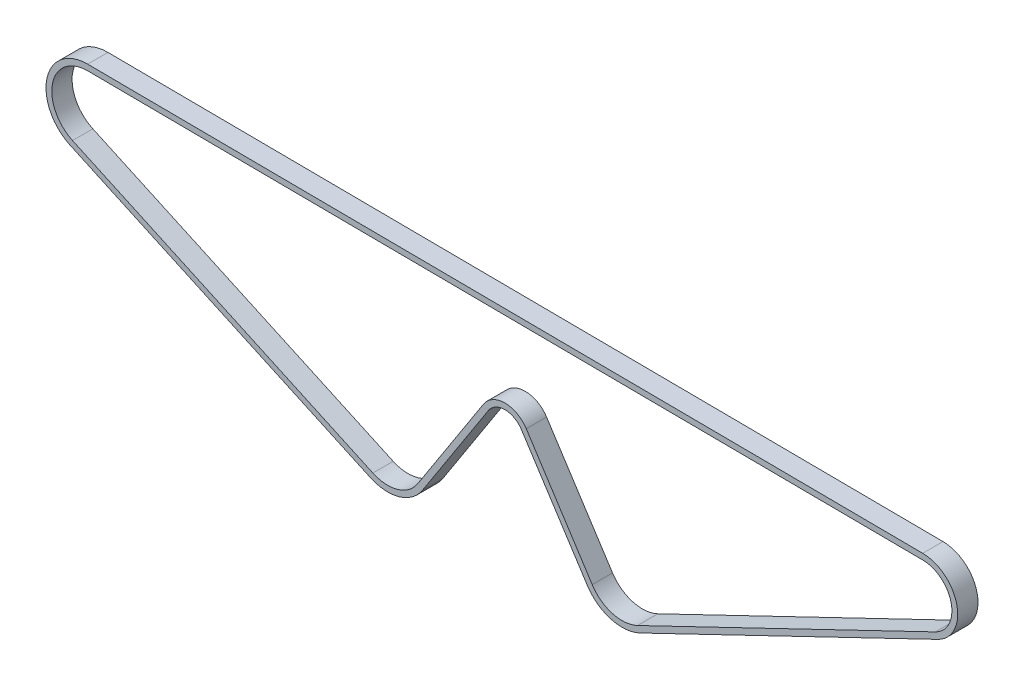
ISO-10303-21;
HEADER;
FILE_DESCRIPTION(('STEP AP214'),'2;1');
FILE_NAME('part.step','',(''),(''),'','','');
FILE_SCHEMA(('AUTOMOTIVE_DESIGN { 1 0 10303 214 1 1 1 1 }'));
ENDSEC;
DATA;
#1=APPLICATION_CONTEXT('core data for automotive mechanical design processes');
#2=APPLICATION_PROTOCOL_DEFINITION('international standard','automotive_design',2000,#1);
#3=PRODUCT_CONTEXT('',#1,'mechanical');
#4=PRODUCT('Part','Part','',(#3));
#5=PRODUCT_RELATED_PRODUCT_CATEGORY('part','',(#4));
#6=PRODUCT_DEFINITION_FORMATION('','',#4);
#7=PRODUCT_DEFINITION_CONTEXT('part definition',#1,'design');
#8=PRODUCT_DEFINITION('design','',#6,#7);
#9=PRODUCT_DEFINITION_SHAPE('','',#8);
#10=(LENGTH_UNIT() NAMED_UNIT(*) SI_UNIT(.MILLI.,.METRE.));
#11=(NAMED_UNIT(*) PLANE_ANGLE_UNIT() SI_UNIT($,.RADIAN.));
#12=(NAMED_UNIT(*) SI_UNIT($,.STERADIAN.) SOLID_ANGLE_UNIT());
#13=UNCERTAINTY_MEASURE_WITH_UNIT(LENGTH_MEASURE(1.E-05),#10,'distance_accuracy_value','');
#14=(GEOMETRIC_REPRESENTATION_CONTEXT(3) GLOBAL_UNCERTAINTY_ASSIGNED_CONTEXT((#13)) GLOBAL_UNIT_ASSIGNED_CONTEXT((#10,
#11,#12)) REPRESENTATION_CONTEXT('',''));
#15=CARTESIAN_POINT('',(0.,0.,0.));
#16=DIRECTION('',(0.,0.,1.));
#17=DIRECTION('',(1.,0.,0.));
#18=AXIS2_PLACEMENT_3D('',#15,#16,#17);
#19=CARTESIAN_POINT('',(143.941250098776,23.749999999998,7.));
#20=DIRECTION('',(0.,0.,1.));
#21=DIRECTION('',(1.,0.,0.));
#22=AXIS2_PLACEMENT_3D('',#19,#20,#21);
#23=PLANE('',#22);
#24=CARTESIAN_POINT('',(143.941250098776,23.749999999998,7.));
#25=DIRECTION('',(0.,0.,1.));
#26=DIRECTION('',(1.,0.,0.));
#27=AXIS2_PLACEMENT_3D('',#24,#25,#26);
#28=CIRCLE('',#27,12.1599999999997);
#29=CARTESIAN_POINT('',(149.215463731583,12.7933458320732,7.));
#30=VERTEX_POINT('',#29);
#31=CARTESIAN_POINT('',(144.030375349469,35.9096733792335,7.));
#32=VERTEX_POINT('',#31);
#33=EDGE_CURVE('E251',#30,#32,#28,.T.);
#34=ORIENTED_EDGE('',*,*,#33,.T.);
#35=DIRECTION('',(-0.999973139739763,0.00732937916876537,0.));
#36=VECTOR('',#35,1.);
#37=CARTESIAN_POINT('',(-143.836659858044,38.0196167040845,7.));
#38=LINE('',#37,#36);
#39=CARTESIAN_POINT('',(-143.836659858044,38.0196167040845,7.));
#40=VERTEX_POINT('',#39);
#41=EDGE_CURVE('E254',#32,#40,#38,.T.);
#42=ORIENTED_EDGE('',*,*,#41,.T.);
#43=CARTESIAN_POINT('',(-143.941250098782,23.7499999999981,7.));
#44=DIRECTION('',(0.,0.,1.));
#45=DIRECTION('',(1.,0.,0.));
#46=AXIS2_PLACEMENT_3D('',#43,#44,#45);
#47=CIRCLE('',#46,14.27);
#48=CARTESIAN_POINT('',(-149.891425293205,10.7797141451805,7.));
#49=VERTEX_POINT('',#48);
#50=EDGE_CURVE('E257',#40,#49,#47,.T.);
#51=ORIENTED_EDGE('',*,*,#50,.T.);
#52=DIRECTION('',(0.908919821641036,-0.41697093163436,0.));
#53=VECTOR('',#52,1.);
#54=CARTESIAN_POINT('',(-46.3501751664253,-36.7202858548198,7.));
#55=LINE('',#54,#53);
#56=CARTESIAN_POINT('',(-46.3501751664248,-36.7202858548186,7.));
#57=VERTEX_POINT('',#56);
#58=EDGE_CURVE('E259',#49,#57,#55,.T.);
#59=ORIENTED_EDGE('',*,*,#58,.T.);
#60=CARTESIAN_POINT('',(-40.3999999720011,-23.7500000000016,7.));
#61=DIRECTION('',(0.,0.,1.));
#62=DIRECTION('',(1.,0.,0.));
#63=AXIS2_PLACEMENT_3D('',#60,#61,#62);
#64=CIRCLE('',#63,14.2700000000001);
#65=CARTESIAN_POINT('',(-28.4149704281197,-31.4954481363107,7.));
#66=VERTEX_POINT('',#65);
#67=EDGE_CURVE('E261',#57,#66,#64,.T.);
#68=ORIENTED_EDGE('',*,*,#67,.T.);
#69=DIRECTION('',(0.54277842580998,0.83987593159659,0.));
#70=VECTOR('',#69,1.);
#71=CARTESIAN_POINT('',(-5.68596005690916,3.67460994273322,7.));
#72=LINE('',#71,#70);
#73=CARTESIAN_POINT('',(-5.68596005690916,3.67460994273321,7.));
#74=VERTEX_POINT('',#73);
#75=EDGE_CURVE('E263',#66,#74,#72,.T.);
#76=ORIENTED_EDGE('',*,*,#75,.T.);
#77=CARTESIAN_POINT('',(0.,0.,7.));
#78=DIRECTION('',(0.,0.,-1.));
#79=DIRECTION('',(1.,0.,0.));
#80=AXIS2_PLACEMENT_3D('',#77,#78,#79);
#81=CIRCLE('',#80,6.77000000000002);
#82=CARTESIAN_POINT('',(5.68596005690901,3.67460994273342,7.));
#83=VERTEX_POINT('',#82);
#84=EDGE_CURVE('E265',#74,#83,#81,.T.);
#85=ORIENTED_EDGE('',*,*,#84,.T.);
#86=DIRECTION('',(0.542778425809879,-0.839875931596656,0.));
#87=VECTOR('',#86,1.);
#88=CARTESIAN_POINT('',(28.4149704281127,-31.4954481363091,7.));
#89=LINE('',#88,#87);
#90=CARTESIAN_POINT('',(28.4149704281127,-31.4954481363091,7.));
#91=VERTEX_POINT('',#90);
#92=EDGE_CURVE('E267',#83,#91,#89,.T.);
#93=ORIENTED_EDGE('',*,*,#92,.T.);
#94=CARTESIAN_POINT('',(40.3999999719969,-23.7500000000022,7.));
#95=DIRECTION('',(0.,0.,1.));
#96=DIRECTION('',(1.,0.,0.));
#97=AXIS2_PLACEMENT_3D('',#94,#95,#96);
#98=CIRCLE('',#97,14.27);
#99=CARTESIAN_POINT('',(46.5893937664168,-36.6078499158161,7.));
#100=VERTEX_POINT('',#99);
#101=EDGE_CURVE('E269',#91,#100,#98,.T.);
#102=ORIENTED_EDGE('',*,*,#101,.T.);
#103=DIRECTION('',(0.901040638809665,0.433734673750522,0.));
#104=VECTOR('',#103,1.);
#105=CARTESIAN_POINT('',(149.215463731583,12.7933458320732,7.));
#106=LINE('',#105,#104);
#107=EDGE_CURVE('E271',#100,#30,#106,.T.);
#108=ORIENTED_EDGE('',*,*,#107,.T.);
#109=EDGE_LOOP('',(#34,#42,#51,#59,#68,#76,#85,#93,#102,#108));
#110=FACE_BOUND('',#109,.T.);
#111=DIRECTION('',(-0.999973139739763,0.00732937916876538,0.));
#112=VECTOR('',#111,1.);
#113=CARTESIAN_POINT('',(-143.851318616382,36.019670424605,7.));
#114=LINE('',#113,#112);
#115=CARTESIAN_POINT('',(144.015716591131,33.909727099754,7.));
#116=VERTEX_POINT('',#115);
#117=CARTESIAN_POINT('',(-143.851318616382,36.019670424605,7.));
#118=VERTEX_POINT('',#117);
#119=EDGE_CURVE('E180',#116,#118,#114,.T.);
#120=ORIENTED_EDGE('',*,*,#119,.F.);
#121=CARTESIAN_POINT('',(143.941250098776,23.749999999998,7.));
#122=DIRECTION('',(0.,0.,1.));
#123=DIRECTION('',(1.,0.,0.));
#124=AXIS2_PLACEMENT_3D('',#121,#122,#123);
#125=CIRCLE('',#124,10.16);
#126=CARTESIAN_POINT('',(148.347994384082,14.5954271096918,7.));
#127=VERTEX_POINT('',#126);
#128=EDGE_CURVE('E172',#127,#116,#125,.T.);
#129=ORIENTED_EDGE('',*,*,#128,.F.);
#130=DIRECTION('',(0.901040638809667,0.433734673750516,0.));
#131=VECTOR('',#130,1.);
#132=CARTESIAN_POINT('',(148.347994384082,14.5954271096918,7.));
#133=LINE('',#132,#131);
#134=CARTESIAN_POINT('',(45.7219244189158,-34.8057686381968,7.));
#135=VERTEX_POINT('',#134);
#136=EDGE_CURVE('E209',#135,#127,#133,.T.);
#137=ORIENTED_EDGE('',*,*,#136,.F.);
#138=CARTESIAN_POINT('',(40.3999999719969,-23.7500000000022,7.));
#139=DIRECTION('',(0.,0.,1.));
#140=DIRECTION('',(1.,0.,0.));
#141=AXIS2_PLACEMENT_3D('',#138,#139,#140);
#142=CIRCLE('',#141,12.27);
#143=CARTESIAN_POINT('',(30.094722291306,-30.4098912846894,7.));
#144=VERTEX_POINT('',#143);
#145=EDGE_CURVE('E207',#144,#135,#142,.T.);
#146=ORIENTED_EDGE('',*,*,#145,.F.);
#147=DIRECTION('',(0.542778425809879,-0.839875931596656,0.));
#148=VECTOR('',#147,1.);
#149=CARTESIAN_POINT('',(30.094722291306,-30.4098912846894,7.));
#150=LINE('',#149,#148);
#151=CARTESIAN_POINT('',(7.36571192010266,4.76016679435264,7.));
#152=VERTEX_POINT('',#151);
#153=EDGE_CURVE('E205',#152,#144,#150,.T.);
#154=ORIENTED_EDGE('',*,*,#153,.F.);
#155=CARTESIAN_POINT('',(0.,0.,7.));
#156=DIRECTION('',(0.,0.,-1.));
#157=DIRECTION('',(1.,0.,0.));
#158=AXIS2_PLACEMENT_3D('',#155,#156,#157);
#159=CIRCLE('',#158,8.77);
#160=CARTESIAN_POINT('',(-7.3657119201021,4.76016679435353,7.));
#161=VERTEX_POINT('',#160);
#162=EDGE_CURVE('E203',#161,#152,#159,.T.);
#163=ORIENTED_EDGE('',*,*,#162,.F.);
#164=DIRECTION('',(0.54277842580998,0.83987593159659,0.));
#165=VECTOR('',#164,1.);
#166=CARTESIAN_POINT('',(-7.3657119201021,4.76016679435353,7.));
#167=LINE('',#166,#165);
#168=CARTESIAN_POINT('',(-30.0947222913129,-30.4098912846907,7.));
#169=VERTEX_POINT('',#168);
#170=EDGE_CURVE('E201',#169,#161,#167,.T.);
#171=ORIENTED_EDGE('',*,*,#170,.F.);
#172=CARTESIAN_POINT('',(-40.399999972003,-23.7500000000022,7.));
#173=DIRECTION('',(0.,0.,1.));
#174=DIRECTION('',(1.,0.,0.));
#175=AXIS2_PLACEMENT_3D('',#172,#173,#174);
#176=CIRCLE('',#175,12.27);
#177=CARTESIAN_POINT('',(-45.5162333031566,-34.9024462115378,7.));
#178=VERTEX_POINT('',#177);
#179=EDGE_CURVE('E199',#178,#169,#176,.T.);
#180=ORIENTED_EDGE('',*,*,#179,.F.);
#181=DIRECTION('',(0.908919821641036,-0.41697093163436,0.));
#182=VECTOR('',#181,1.);
#183=CARTESIAN_POINT('',(-45.5162333031566,-34.9024462115378,7.));
#184=LINE('',#183,#182);
#185=CARTESIAN_POINT('',(-149.057483429936,12.5975537884626,7.));
#186=VERTEX_POINT('',#185);
#187=EDGE_CURVE('E195',#186,#178,#184,.T.);
#188=ORIENTED_EDGE('',*,*,#187,.F.);
#189=CARTESIAN_POINT('',(-143.941250098782,23.7499999999981,7.));
#190=DIRECTION('',(0.,0.,1.));
#191=DIRECTION('',(1.,0.,0.));
#192=AXIS2_PLACEMENT_3D('',#189,#190,#191);
#193=CIRCLE('',#192,12.27);
#194=EDGE_CURVE('E193',#118,#186,#193,.T.);
#195=ORIENTED_EDGE('',*,*,#194,.F.);
#196=EDGE_LOOP('',(#120,#129,#137,#146,#154,#163,#171,#180,#188,#195));
#197=FACE_BOUND('',#196,.T.);
#198=ADVANCED_FACE('F35',(#110,#197),#23,.T.);
#199=CARTESIAN_POINT('',(143.941250098776,23.749999999998,0.));
#200=DIRECTION('',(0.,0.,1.));
#201=DIRECTION('',(1.,0.,0.));
#202=AXIS2_PLACEMENT_3D('',#199,#200,#201);
#203=PLANE('',#202);
#204=CARTESIAN_POINT('',(143.941250098776,23.749999999998,0.));
#205=DIRECTION('',(0.,0.,1.));
#206=DIRECTION('',(1.,0.,0.));
#207=AXIS2_PLACEMENT_3D('',#204,#205,#206);
#208=CIRCLE('',#207,12.1599999999997);
#209=CARTESIAN_POINT('',(149.215463731583,12.7933458320732,0.));
#210=VERTEX_POINT('',#209);
#211=CARTESIAN_POINT('',(144.030375349469,35.9096733792335,0.));
#212=VERTEX_POINT('',#211);
#213=EDGE_CURVE('E188',#210,#212,#208,.T.);
#214=ORIENTED_EDGE('',*,*,#213,.F.);
#215=DIRECTION('',(0.901040638809665,0.433734673750522,0.));
#216=VECTOR('',#215,1.);
#217=CARTESIAN_POINT('',(149.215463731583,12.7933458320732,0.));
#218=LINE('',#217,#216);
#219=CARTESIAN_POINT('',(46.5893937664168,-36.6078499158161,0.));
#220=VERTEX_POINT('',#219);
#221=EDGE_CURVE('E255',#220,#210,#218,.T.);
#222=ORIENTED_EDGE('',*,*,#221,.F.);
#223=CARTESIAN_POINT('',(40.3999999719969,-23.7500000000022,0.));
#224=DIRECTION('',(0.,0.,1.));
#225=DIRECTION('',(1.,0.,0.));
#226=AXIS2_PLACEMENT_3D('',#223,#224,#225);
#227=CIRCLE('',#226,14.27);
#228=CARTESIAN_POINT('',(28.4149704281127,-31.4954481363091,0.));
#229=VERTEX_POINT('',#228);
#230=EDGE_CURVE('E290',#229,#220,#227,.T.);
#231=ORIENTED_EDGE('',*,*,#230,.F.);
#232=DIRECTION('',(0.542778425809879,-0.839875931596656,0.));
#233=VECTOR('',#232,1.);
#234=CARTESIAN_POINT('',(28.4149704281127,-31.4954481363091,0.));
#235=LINE('',#234,#233);
#236=CARTESIAN_POINT('',(5.68596005690901,3.67460994273342,0.));
#237=VERTEX_POINT('',#236);
#238=EDGE_CURVE('E288',#237,#229,#235,.T.);
#239=ORIENTED_EDGE('',*,*,#238,.F.);
#240=CARTESIAN_POINT('',(0.,0.,0.));
#241=DIRECTION('',(0.,0.,-1.));
#242=DIRECTION('',(1.,0.,0.));
#243=AXIS2_PLACEMENT_3D('',#240,#241,#242);
#244=CIRCLE('',#243,6.77000000000002);
#245=CARTESIAN_POINT('',(-5.68596005690916,3.67460994273321,0.));
#246=VERTEX_POINT('',#245);
#247=EDGE_CURVE('E286',#246,#237,#244,.T.);
#248=ORIENTED_EDGE('',*,*,#247,.F.);
#249=DIRECTION('',(0.54277842580998,0.83987593159659,0.));
#250=VECTOR('',#249,1.);
#251=CARTESIAN_POINT('',(-5.68596005690916,3.67460994273322,0.));
#252=LINE('',#251,#250);
#253=CARTESIAN_POINT('',(-28.4149704281197,-31.4954481363107,0.));
#254=VERTEX_POINT('',#253);
#255=EDGE_CURVE('E284',#254,#246,#252,.T.);
#256=ORIENTED_EDGE('',*,*,#255,.F.);
#257=CARTESIAN_POINT('',(-40.3999999720011,-23.7500000000016,0.));
#258=DIRECTION('',(0.,0.,1.));
#259=DIRECTION('',(1.,0.,0.));
#260=AXIS2_PLACEMENT_3D('',#257,#258,#259);
#261=CIRCLE('',#260,14.2700000000001);
#262=CARTESIAN_POINT('',(-46.3501751664248,-36.7202858548186,0.));
#263=VERTEX_POINT('',#262);
#264=EDGE_CURVE('E282',#263,#254,#261,.T.);
#265=ORIENTED_EDGE('',*,*,#264,.F.);
#266=DIRECTION('',(0.908919821641036,-0.41697093163436,0.));
#267=VECTOR('',#266,1.);
#268=CARTESIAN_POINT('',(-46.3501751664253,-36.7202858548198,0.));
#269=LINE('',#268,#267);
#270=CARTESIAN_POINT('',(-149.891425293205,10.7797141451805,0.));
#271=VERTEX_POINT('',#270);
#272=EDGE_CURVE('E280',#271,#263,#269,.T.);
#273=ORIENTED_EDGE('',*,*,#272,.F.);
#274=CARTESIAN_POINT('',(-143.941250098782,23.7499999999981,0.));
#275=DIRECTION('',(0.,0.,1.));
#276=DIRECTION('',(1.,0.,0.));
#277=AXIS2_PLACEMENT_3D('',#274,#275,#276);
#278=CIRCLE('',#277,14.27);
#279=CARTESIAN_POINT('',(-143.836659858044,38.0196167040845,0.));
#280=VERTEX_POINT('',#279);
#281=EDGE_CURVE('E278',#280,#271,#278,.T.);
#282=ORIENTED_EDGE('',*,*,#281,.F.);
#283=DIRECTION('',(-0.999973139739763,0.00732937916876537,0.));
#284=VECTOR('',#283,1.);
#285=CARTESIAN_POINT('',(-143.836659858044,38.0196167040845,0.));
#286=LINE('',#285,#284);
#287=EDGE_CURVE('E276',#212,#280,#286,.T.);
#288=ORIENTED_EDGE('',*,*,#287,.F.);
#289=EDGE_LOOP('',(#214,#222,#231,#239,#248,#256,#265,#273,#282,#288));
#290=FACE_BOUND('',#289,.T.);
#291=CARTESIAN_POINT('',(143.941250098776,23.749999999998,0.));
#292=DIRECTION('',(0.,0.,1.));
#293=DIRECTION('',(1.,0.,0.));
#294=AXIS2_PLACEMENT_3D('',#291,#292,#293);
#295=CIRCLE('',#294,10.16);
#296=CARTESIAN_POINT('',(148.347994384082,14.5954271096918,0.));
#297=VERTEX_POINT('',#296);
#298=CARTESIAN_POINT('',(144.015716591131,33.909727099754,0.));
#299=VERTEX_POINT('',#298);
#300=EDGE_CURVE('E58',#297,#299,#295,.T.);
#301=ORIENTED_EDGE('',*,*,#300,.T.);
#302=DIRECTION('',(-0.999973139739763,0.00732937916876538,0.));
#303=VECTOR('',#302,1.);
#304=CARTESIAN_POINT('',(-143.851318616382,36.019670424605,0.));
#305=LINE('',#304,#303);
#306=CARTESIAN_POINT('',(-143.851318616382,36.019670424605,0.));
#307=VERTEX_POINT('',#306);
#308=EDGE_CURVE('E187',#299,#307,#305,.T.);
#309=ORIENTED_EDGE('',*,*,#308,.T.);
#310=CARTESIAN_POINT('',(-143.941250098782,23.7499999999981,0.));
#311=DIRECTION('',(0.,0.,1.));
#312=DIRECTION('',(1.,0.,0.));
#313=AXIS2_PLACEMENT_3D('',#310,#311,#312);
#314=CIRCLE('',#313,12.27);
#315=CARTESIAN_POINT('',(-149.057483429936,12.5975537884626,0.));
#316=VERTEX_POINT('',#315);
#317=EDGE_CURVE('E213',#307,#316,#314,.T.);
#318=ORIENTED_EDGE('',*,*,#317,.T.);
#319=DIRECTION('',(0.908919821641036,-0.41697093163436,0.));
#320=VECTOR('',#319,1.);
#321=CARTESIAN_POINT('',(-45.5162333031566,-34.9024462115378,0.));
#322=LINE('',#321,#320);
#323=CARTESIAN_POINT('',(-45.5162333031566,-34.9024462115378,0.));
#324=VERTEX_POINT('',#323);
#325=EDGE_CURVE('E216',#316,#324,#322,.T.);
#326=ORIENTED_EDGE('',*,*,#325,.T.);
#327=CARTESIAN_POINT('',(-40.399999972003,-23.7500000000022,0.));
#328=DIRECTION('',(0.,0.,1.));
#329=DIRECTION('',(1.,0.,0.));
#330=AXIS2_PLACEMENT_3D('',#327,#328,#329);
#331=CIRCLE('',#330,12.27);
#332=CARTESIAN_POINT('',(-30.0947222913129,-30.4098912846907,0.));
#333=VERTEX_POINT('',#332);
#334=EDGE_CURVE('E219',#324,#333,#331,.T.);
#335=ORIENTED_EDGE('',*,*,#334,.T.);
#336=DIRECTION('',(0.54277842580998,0.83987593159659,0.));
#337=VECTOR('',#336,1.);
#338=CARTESIAN_POINT('',(-7.3657119201021,4.76016679435353,0.));
#339=LINE('',#338,#337);
#340=CARTESIAN_POINT('',(-7.3657119201021,4.76016679435353,0.));
#341=VERTEX_POINT('',#340);
#342=EDGE_CURVE('E222',#333,#341,#339,.T.);
#343=ORIENTED_EDGE('',*,*,#342,.T.);
#344=CARTESIAN_POINT('',(0.,0.,0.));
#345=DIRECTION('',(0.,0.,-1.));
#346=DIRECTION('',(1.,0.,0.));
#347=AXIS2_PLACEMENT_3D('',#344,#345,#346);
#348=CIRCLE('',#347,8.77);
#349=CARTESIAN_POINT('',(7.36571192010266,4.76016679435264,0.));
#350=VERTEX_POINT('',#349);
#351=EDGE_CURVE('E225',#341,#350,#348,.T.);
#352=ORIENTED_EDGE('',*,*,#351,.T.);
#353=DIRECTION('',(0.542778425809879,-0.839875931596656,0.));
#354=VECTOR('',#353,1.);
#355=CARTESIAN_POINT('',(30.094722291306,-30.4098912846894,0.));
#356=LINE('',#355,#354);
#357=CARTESIAN_POINT('',(30.094722291306,-30.4098912846894,0.));
#358=VERTEX_POINT('',#357);
#359=EDGE_CURVE('E228',#350,#358,#356,.T.);
#360=ORIENTED_EDGE('',*,*,#359,.T.);
#361=CARTESIAN_POINT('',(40.3999999719969,-23.7500000000022,0.));
#362=DIRECTION('',(0.,0.,1.));
#363=DIRECTION('',(1.,0.,0.));
#364=AXIS2_PLACEMENT_3D('',#361,#362,#363);
#365=CIRCLE('',#364,12.27);
#366=CARTESIAN_POINT('',(45.7219244189158,-34.8057686381968,0.));
#367=VERTEX_POINT('',#366);
#368=EDGE_CURVE('E231',#358,#367,#365,.T.);
#369=ORIENTED_EDGE('',*,*,#368,.T.);
#370=DIRECTION('',(0.901040638809667,0.433734673750516,0.));
#371=VECTOR('',#370,1.);
#372=CARTESIAN_POINT('',(148.347994384082,14.5954271096918,0.));
#373=LINE('',#372,#371);
#374=EDGE_CURVE('E181',#367,#297,#373,.T.);
#375=ORIENTED_EDGE('',*,*,#374,.T.);
#376=EDGE_LOOP('',(#301,#309,#318,#326,#335,#343,#352,#360,#369,#375));
#377=FACE_BOUND('',#376,.T.);
#378=ADVANCED_FACE('F326',(#290,#377),#203,.F.);
#379=CARTESIAN_POINT('',(143.941250098776,23.749999999998,7.));
#380=DIRECTION('',(0.,0.,-1.));
#381=DIRECTION('',(-1.,0.,0.));
#382=AXIS2_PLACEMENT_3D('',#379,#380,#381);
#383=CYLINDRICAL_SURFACE('',#382,12.1599999999997);
#384=ORIENTED_EDGE('',*,*,#213,.T.);
#385=DIRECTION('',(0.,0.,-1.));
#386=VECTOR('',#385,1.);
#387=CARTESIAN_POINT('',(144.030375349469,35.9096733792335,7.));
#388=LINE('',#387,#386);
#389=EDGE_CURVE('E11',#32,#212,#388,.T.);
#390=ORIENTED_EDGE('',*,*,#389,.F.);
#391=ORIENTED_EDGE('',*,*,#33,.F.);
#392=DIRECTION('',(0.,0.,-1.));
#393=VECTOR('',#392,1.);
#394=CARTESIAN_POINT('',(149.215463731583,12.7933458320732,7.));
#395=LINE('',#394,#393);
#396=EDGE_CURVE('E273',#30,#210,#395,.T.);
#397=ORIENTED_EDGE('',*,*,#396,.T.);
#398=EDGE_LOOP('',(#384,#390,#391,#397));
#399=FACE_BOUND('',#398,.T.);
#400=ADVANCED_FACE('F37',(#399),#383,.T.);
#401=CARTESIAN_POINT('',(-143.836659858044,38.0196167040845,7.));
#402=DIRECTION('',(-0.00732937916876537,-0.999973139739763,0.));
#403=DIRECTION('',(0.999973139739764,-0.00732937916876537,0.));
#404=AXIS2_PLACEMENT_3D('',#401,#402,#403);
#405=PLANE('',#404);
#406=ORIENTED_EDGE('',*,*,#287,.T.);
#407=DIRECTION('',(0.,0.,-1.));
#408=VECTOR('',#407,1.);
#409=CARTESIAN_POINT('',(-143.836659858044,38.0196167040845,7.));
#410=LINE('',#409,#408);
#411=EDGE_CURVE('E43',#40,#280,#410,.T.);
#412=ORIENTED_EDGE('',*,*,#411,.F.);
#413=ORIENTED_EDGE('',*,*,#41,.F.);
#414=ORIENTED_EDGE('',*,*,#389,.T.);
#415=EDGE_LOOP('',(#406,#412,#413,#414));
#416=FACE_BOUND('',#415,.T.);
#417=ADVANCED_FACE('F343',(#416),#405,.F.);
#418=CARTESIAN_POINT('',(-143.941250098782,23.7499999999981,7.));
#419=DIRECTION('',(0.,0.,-1.));
#420=DIRECTION('',(-1.,0.,0.));
#421=AXIS2_PLACEMENT_3D('',#418,#419,#420);
#422=CYLINDRICAL_SURFACE('',#421,14.27);
#423=ORIENTED_EDGE('',*,*,#281,.T.);
#424=DIRECTION('',(0.,0.,-1.));
#425=VECTOR('',#424,1.);
#426=CARTESIAN_POINT('',(-149.891425293205,10.7797141451805,7.));
#427=LINE('',#426,#425);
#428=EDGE_CURVE('E313',#49,#271,#427,.T.);
#429=ORIENTED_EDGE('',*,*,#428,.F.);
#430=ORIENTED_EDGE('',*,*,#50,.F.);
#431=ORIENTED_EDGE('',*,*,#411,.T.);
#432=EDGE_LOOP('',(#423,#429,#430,#431));
#433=FACE_BOUND('',#432,.T.);
#434=ADVANCED_FACE('F320',(#433),#422,.T.);
#435=CARTESIAN_POINT('',(-46.3501751664253,-36.7202858548198,7.));
#436=DIRECTION('',(0.41697093163436,0.908919821641036,0.));
#437=DIRECTION('',(-0.908919821641036,0.41697093163436,0.));
#438=AXIS2_PLACEMENT_3D('',#435,#436,#437);
#439=PLANE('',#438);
#440=ORIENTED_EDGE('',*,*,#272,.T.);
#441=DIRECTION('',(0.,0.,-1.));
#442=VECTOR('',#441,1.);
#443=CARTESIAN_POINT('',(-46.3501751664248,-36.7202858548186,7.));
#444=LINE('',#443,#442);
#445=EDGE_CURVE('E310',#57,#263,#444,.T.);
#446=ORIENTED_EDGE('',*,*,#445,.F.);
#447=ORIENTED_EDGE('',*,*,#58,.F.);
#448=ORIENTED_EDGE('',*,*,#428,.T.);
#449=EDGE_LOOP('',(#440,#446,#447,#448));
#450=FACE_BOUND('',#449,.T.);
#451=ADVANCED_FACE('F332',(#450),#439,.F.);
#452=CARTESIAN_POINT('',(-40.3999999720011,-23.7500000000016,7.));
#453=DIRECTION('',(0.,0.,-1.));
#454=DIRECTION('',(-1.,0.,0.));
#455=AXIS2_PLACEMENT_3D('',#452,#453,#454);
#456=CYLINDRICAL_SURFACE('',#455,14.2700000000001);
#457=ORIENTED_EDGE('',*,*,#264,.T.);
#458=DIRECTION('',(0.,0.,-1.));
#459=VECTOR('',#458,1.);
#460=CARTESIAN_POINT('',(-28.4149704281197,-31.4954481363107,7.));
#461=LINE('',#460,#459);
#462=EDGE_CURVE('E307',#66,#254,#461,.T.);
#463=ORIENTED_EDGE('',*,*,#462,.F.);
#464=ORIENTED_EDGE('',*,*,#67,.F.);
#465=ORIENTED_EDGE('',*,*,#445,.T.);
#466=EDGE_LOOP('',(#457,#463,#464,#465));
#467=FACE_BOUND('',#466,.T.);
#468=ADVANCED_FACE('F336',(#467),#456,.T.);
#469=CARTESIAN_POINT('',(-5.68596005690916,3.67460994273322,7.));
#470=DIRECTION('',(-0.83987593159659,0.54277842580998,0.));
#471=DIRECTION('',(-0.54277842580998,-0.83987593159659,0.));
#472=AXIS2_PLACEMENT_3D('',#469,#470,#471);
#473=PLANE('',#472);
#474=ORIENTED_EDGE('',*,*,#255,.T.);
#475=DIRECTION('',(0.,0.,-1.));
#476=VECTOR('',#475,1.);
#477=CARTESIAN_POINT('',(-5.68596005690916,3.67460994273321,7.));
#478=LINE('',#477,#476);
#479=EDGE_CURVE('E304',#74,#246,#478,.T.);
#480=ORIENTED_EDGE('',*,*,#479,.F.);
#481=ORIENTED_EDGE('',*,*,#75,.F.);
#482=ORIENTED_EDGE('',*,*,#462,.T.);
#483=EDGE_LOOP('',(#474,#480,#481,#482));
#484=FACE_BOUND('',#483,.T.);
#485=ADVANCED_FACE('F366',(#484),#473,.F.);
#486=CARTESIAN_POINT('',(0.,0.,7.));
#487=DIRECTION('',(0.,0.,-1.));
#488=DIRECTION('',(-1.,0.,0.));
#489=AXIS2_PLACEMENT_3D('',#486,#487,#488);
#490=CYLINDRICAL_SURFACE('',#489,6.77000000000002);
#491=ORIENTED_EDGE('',*,*,#247,.T.);
#492=DIRECTION('',(0.,0.,-1.));
#493=VECTOR('',#492,1.);
#494=CARTESIAN_POINT('',(5.68596005690901,3.67460994273342,7.));
#495=LINE('',#494,#493);
#496=EDGE_CURVE('E301',#83,#237,#495,.T.);
#497=ORIENTED_EDGE('',*,*,#496,.F.);
#498=ORIENTED_EDGE('',*,*,#84,.F.);
#499=ORIENTED_EDGE('',*,*,#479,.T.);
#500=EDGE_LOOP('',(#491,#497,#498,#499));
#501=FACE_BOUND('',#500,.T.);
#502=ADVANCED_FACE('F363',(#501),#490,.F.);
#503=CARTESIAN_POINT('',(28.4149704281127,-31.4954481363091,7.));
#504=DIRECTION('',(0.839875931596656,0.542778425809879,0.));
#505=DIRECTION('',(-0.542778425809879,0.839875931596656,0.));
#506=AXIS2_PLACEMENT_3D('',#503,#504,#505);
#507=PLANE('',#506);
#508=ORIENTED_EDGE('',*,*,#238,.T.);
#509=DIRECTION('',(0.,0.,-1.));
#510=VECTOR('',#509,1.);
#511=CARTESIAN_POINT('',(28.4149704281127,-31.4954481363091,7.));
#512=LINE('',#511,#510);
#513=EDGE_CURVE('E298',#91,#229,#512,.T.);
#514=ORIENTED_EDGE('',*,*,#513,.F.);
#515=ORIENTED_EDGE('',*,*,#92,.F.);
#516=ORIENTED_EDGE('',*,*,#496,.T.);
#517=EDGE_LOOP('',(#508,#514,#515,#516));
#518=FACE_BOUND('',#517,.T.);
#519=ADVANCED_FACE('F359',(#518),#507,.F.);
#520=CARTESIAN_POINT('',(40.3999999719969,-23.7500000000022,7.));
#521=DIRECTION('',(0.,0.,-1.));
#522=DIRECTION('',(-1.,0.,0.));
#523=AXIS2_PLACEMENT_3D('',#520,#521,#522);
#524=CYLINDRICAL_SURFACE('',#523,14.27);
#525=ORIENTED_EDGE('',*,*,#230,.T.);
#526=DIRECTION('',(0.,0.,-1.));
#527=VECTOR('',#526,1.);
#528=CARTESIAN_POINT('',(46.5893937664168,-36.6078499158161,7.));
#529=LINE('',#528,#527);
#530=EDGE_CURVE('E295',#100,#220,#529,.T.);
#531=ORIENTED_EDGE('',*,*,#530,.F.);
#532=ORIENTED_EDGE('',*,*,#101,.F.);
#533=ORIENTED_EDGE('',*,*,#513,.T.);
#534=EDGE_LOOP('',(#525,#531,#532,#533));
#535=FACE_BOUND('',#534,.T.);
#536=ADVANCED_FACE('F355',(#535),#524,.T.);
#537=CARTESIAN_POINT('',(149.215463731583,12.7933458320732,7.));
#538=DIRECTION('',(-0.433734673750522,0.901040638809665,0.));
#539=DIRECTION('',(-0.901040638809665,-0.433734673750522,0.));
#540=AXIS2_PLACEMENT_3D('',#537,#538,#539);
#541=PLANE('',#540);
#542=ORIENTED_EDGE('',*,*,#221,.T.);
#543=ORIENTED_EDGE('',*,*,#396,.F.);
#544=ORIENTED_EDGE('',*,*,#107,.F.);
#545=ORIENTED_EDGE('',*,*,#530,.T.);
#546=EDGE_LOOP('',(#542,#543,#544,#545));
#547=FACE_BOUND('',#546,.T.);
#548=ADVANCED_FACE('F350',(#547),#541,.F.);
#549=CARTESIAN_POINT('',(143.941250098776,23.749999999998,7.));
#550=DIRECTION('',(0.,0.,-1.));
#551=DIRECTION('',(-1.,0.,0.));
#552=AXIS2_PLACEMENT_3D('',#549,#550,#551);
#553=CYLINDRICAL_SURFACE('',#552,10.16);
#554=ORIENTED_EDGE('',*,*,#300,.F.);
#555=DIRECTION('',(0.,0.,-1.));
#556=VECTOR('',#555,1.);
#557=CARTESIAN_POINT('',(148.347994384082,14.5954271096918,7.));
#558=LINE('',#557,#556);
#559=EDGE_CURVE('E176',#127,#297,#558,.T.);
#560=ORIENTED_EDGE('',*,*,#559,.F.);
#561=ORIENTED_EDGE('',*,*,#128,.T.);
#562=DIRECTION('',(0.,0.,-1.));
#563=VECTOR('',#562,1.);
#564=CARTESIAN_POINT('',(144.015716591131,33.909727099754,7.));
#565=LINE('',#564,#563);
#566=EDGE_CURVE('E175',#116,#299,#565,.T.);
#567=ORIENTED_EDGE('',*,*,#566,.T.);
#568=EDGE_LOOP('',(#554,#560,#561,#567));
#569=FACE_BOUND('',#568,.T.);
#570=ADVANCED_FACE('F174',(#569),#553,.F.);
#571=CARTESIAN_POINT('',(-143.851318616382,36.019670424605,7.));
#572=DIRECTION('',(-0.00732937916876538,-0.999973139739763,0.));
#573=DIRECTION('',(0.999973139739764,-0.00732937916876538,0.));
#574=AXIS2_PLACEMENT_3D('',#571,#572,#573);
#575=PLANE('',#574);
#576=ORIENTED_EDGE('',*,*,#308,.F.);
#577=ORIENTED_EDGE('',*,*,#566,.F.);
#578=ORIENTED_EDGE('',*,*,#119,.T.);
#579=DIRECTION('',(0.,0.,-1.));
#580=VECTOR('',#579,1.);
#581=CARTESIAN_POINT('',(-143.851318616382,36.019670424605,7.));
#582=LINE('',#581,#580);
#583=EDGE_CURVE('E189',#118,#307,#582,.T.);
#584=ORIENTED_EDGE('',*,*,#583,.T.);
#585=EDGE_LOOP('',(#576,#577,#578,#584));
#586=FACE_BOUND('',#585,.T.);
#587=ADVANCED_FACE('F184',(#586),#575,.T.);
#588=CARTESIAN_POINT('',(-143.941250098782,23.7499999999981,7.));
#589=DIRECTION('',(0.,0.,-1.));
#590=DIRECTION('',(-1.,0.,0.));
#591=AXIS2_PLACEMENT_3D('',#588,#589,#590);
#592=CYLINDRICAL_SURFACE('',#591,12.27);
#593=ORIENTED_EDGE('',*,*,#317,.F.);
#594=ORIENTED_EDGE('',*,*,#583,.F.);
#595=ORIENTED_EDGE('',*,*,#194,.T.);
#596=DIRECTION('',(0.,0.,-1.));
#597=VECTOR('',#596,1.);
#598=CARTESIAN_POINT('',(-149.057483429936,12.5975537884626,7.));
#599=LINE('',#598,#597);
#600=EDGE_CURVE('E248',#186,#316,#599,.T.);
#601=ORIENTED_EDGE('',*,*,#600,.T.);
#602=EDGE_LOOP('',(#593,#594,#595,#601));
#603=FACE_BOUND('',#602,.T.);
#604=ADVANCED_FACE('F412',(#603),#592,.F.);
#605=CARTESIAN_POINT('',(-45.5162333031566,-34.9024462115378,7.));
#606=DIRECTION('',(0.41697093163436,0.908919821641036,0.));
#607=DIRECTION('',(-0.908919821641036,0.41697093163436,0.));
#608=AXIS2_PLACEMENT_3D('',#605,#606,#607);
#609=PLANE('',#608);
#610=ORIENTED_EDGE('',*,*,#325,.F.);
#611=ORIENTED_EDGE('',*,*,#600,.F.);
#612=ORIENTED_EDGE('',*,*,#187,.T.);
#613=DIRECTION('',(0.,0.,-1.));
#614=VECTOR('',#613,1.);
#615=CARTESIAN_POINT('',(-45.5162333031566,-34.9024462115378,7.));
#616=LINE('',#615,#614);
#617=EDGE_CURVE('E246',#178,#324,#616,.T.);
#618=ORIENTED_EDGE('',*,*,#617,.T.);
#619=EDGE_LOOP('',(#610,#611,#612,#618));
#620=FACE_BOUND('',#619,.T.);
#621=ADVANCED_FACE('F418',(#620),#609,.T.);
#622=CARTESIAN_POINT('',(-40.399999972003,-23.7500000000022,7.));
#623=DIRECTION('',(0.,0.,-1.));
#624=DIRECTION('',(-1.,0.,0.));
#625=AXIS2_PLACEMENT_3D('',#622,#623,#624);
#626=CYLINDRICAL_SURFACE('',#625,12.27);
#627=ORIENTED_EDGE('',*,*,#334,.F.);
#628=ORIENTED_EDGE('',*,*,#617,.F.);
#629=ORIENTED_EDGE('',*,*,#179,.T.);
#630=DIRECTION('',(0.,0.,-1.));
#631=VECTOR('',#630,1.);
#632=CARTESIAN_POINT('',(-30.0947222913129,-30.4098912846907,7.));
#633=LINE('',#632,#631);
#634=EDGE_CURVE('E244',#169,#333,#633,.T.);
#635=ORIENTED_EDGE('',*,*,#634,.T.);
#636=EDGE_LOOP('',(#627,#628,#629,#635));
#637=FACE_BOUND('',#636,.T.);
#638=ADVANCED_FACE('F426',(#637),#626,.F.);
#639=CARTESIAN_POINT('',(-7.3657119201021,4.76016679435353,7.));
#640=DIRECTION('',(-0.83987593159659,0.54277842580998,0.));
#641=DIRECTION('',(-0.54277842580998,-0.83987593159659,0.));
#642=AXIS2_PLACEMENT_3D('',#639,#640,#641);
#643=PLANE('',#642);
#644=ORIENTED_EDGE('',*,*,#342,.F.);
#645=ORIENTED_EDGE('',*,*,#634,.F.);
#646=ORIENTED_EDGE('',*,*,#170,.T.);
#647=DIRECTION('',(0.,0.,-1.));
#648=VECTOR('',#647,1.);
#649=CARTESIAN_POINT('',(-7.3657119201021,4.76016679435353,7.));
#650=LINE('',#649,#648);
#651=EDGE_CURVE('E242',#161,#341,#650,.T.);
#652=ORIENTED_EDGE('',*,*,#651,.T.);
#653=EDGE_LOOP('',(#644,#645,#646,#652));
#654=FACE_BOUND('',#653,.T.);
#655=ADVANCED_FACE('F434',(#654),#643,.T.);
#656=CARTESIAN_POINT('',(0.,0.,7.));
#657=DIRECTION('',(0.,0.,-1.));
#658=DIRECTION('',(-1.,0.,0.));
#659=AXIS2_PLACEMENT_3D('',#656,#657,#658);
#660=CYLINDRICAL_SURFACE('',#659,8.77);
#661=ORIENTED_EDGE('',*,*,#351,.F.);
#662=ORIENTED_EDGE('',*,*,#651,.F.);
#663=ORIENTED_EDGE('',*,*,#162,.T.);
#664=DIRECTION('',(0.,0.,-1.));
#665=VECTOR('',#664,1.);
#666=CARTESIAN_POINT('',(7.36571192010266,4.76016679435264,7.));
#667=LINE('',#666,#665);
#668=EDGE_CURVE('E240',#152,#350,#667,.T.);
#669=ORIENTED_EDGE('',*,*,#668,.T.);
#670=EDGE_LOOP('',(#661,#662,#663,#669));
#671=FACE_BOUND('',#670,.T.);
#672=ADVANCED_FACE('F442',(#671),#660,.T.);
#673=CARTESIAN_POINT('',(30.094722291306,-30.4098912846894,7.));
#674=DIRECTION('',(0.839875931596656,0.542778425809879,0.));
#675=DIRECTION('',(-0.542778425809879,0.839875931596656,0.));
#676=AXIS2_PLACEMENT_3D('',#673,#674,#675);
#677=PLANE('',#676);
#678=ORIENTED_EDGE('',*,*,#359,.F.);
#679=ORIENTED_EDGE('',*,*,#668,.F.);
#680=ORIENTED_EDGE('',*,*,#153,.T.);
#681=DIRECTION('',(0.,0.,-1.));
#682=VECTOR('',#681,1.);
#683=CARTESIAN_POINT('',(30.094722291306,-30.4098912846894,7.));
#684=LINE('',#683,#682);
#685=EDGE_CURVE('E238',#144,#358,#684,.T.);
#686=ORIENTED_EDGE('',*,*,#685,.T.);
#687=EDGE_LOOP('',(#678,#679,#680,#686));
#688=FACE_BOUND('',#687,.T.);
#689=ADVANCED_FACE('F450',(#688),#677,.T.);
#690=CARTESIAN_POINT('',(40.3999999719969,-23.7500000000022,7.));
#691=DIRECTION('',(0.,0.,-1.));
#692=DIRECTION('',(-1.,0.,0.));
#693=AXIS2_PLACEMENT_3D('',#690,#691,#692);
#694=CYLINDRICAL_SURFACE('',#693,12.27);
#695=ORIENTED_EDGE('',*,*,#368,.F.);
#696=ORIENTED_EDGE('',*,*,#685,.F.);
#697=ORIENTED_EDGE('',*,*,#145,.T.);
#698=DIRECTION('',(0.,0.,-1.));
#699=VECTOR('',#698,1.);
#700=CARTESIAN_POINT('',(45.7219244189158,-34.8057686381968,7.));
#701=LINE('',#700,#699);
#702=EDGE_CURVE('E50',#135,#367,#701,.T.);
#703=ORIENTED_EDGE('',*,*,#702,.T.);
#704=EDGE_LOOP('',(#695,#696,#697,#703));
#705=FACE_BOUND('',#704,.T.);
#706=ADVANCED_FACE('F458',(#705),#694,.F.);
#707=CARTESIAN_POINT('',(148.347994384082,14.5954271096918,7.));
#708=DIRECTION('',(-0.433734673750516,0.901040638809667,0.));
#709=DIRECTION('',(-0.901040638809667,-0.433734673750516,0.));
#710=AXIS2_PLACEMENT_3D('',#707,#708,#709);
#711=PLANE('',#710);
#712=ORIENTED_EDGE('',*,*,#374,.F.);
#713=ORIENTED_EDGE('',*,*,#702,.F.);
#714=ORIENTED_EDGE('',*,*,#136,.T.);
#715=ORIENTED_EDGE('',*,*,#559,.T.);
#716=EDGE_LOOP('',(#712,#713,#714,#715));
#717=FACE_BOUND('',#716,.T.);
#718=ADVANCED_FACE('F466',(#717),#711,.T.);
#719=CLOSED_SHELL('',(#198,#378,#400,#417,#434,#451,#468,#485,#502,#519,#536,#548,#570,#587,
#604,#621,#638,#655,#672,#689,#706,#718));
#720=MANIFOLD_SOLID_BREP('B2',#719);
#721=ADVANCED_BREP_SHAPE_REPRESENTATION('',(#18,#720),#14);
#722=SHAPE_DEFINITION_REPRESENTATION(#9,#721);
ENDSEC;
END-ISO-10303-21;
